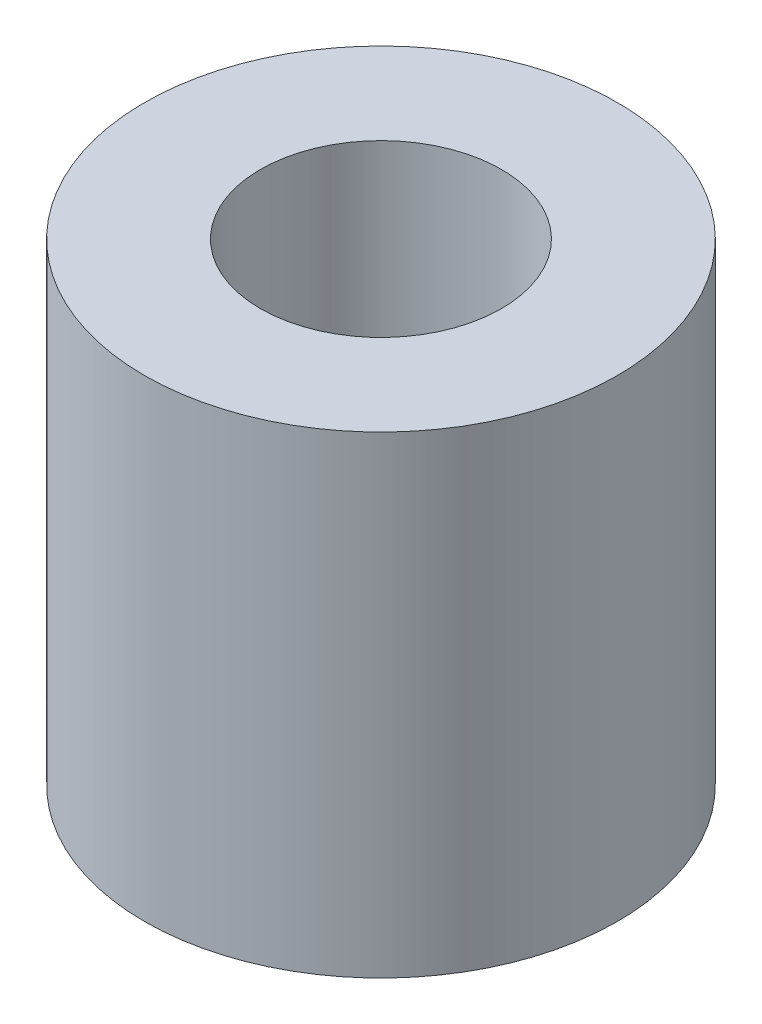
ISO-10303-21;
HEADER;
FILE_DESCRIPTION(('STEP AP214'),'2;1');
FILE_NAME('part.step','',(''),(''),'','','');
FILE_SCHEMA(('AUTOMOTIVE_DESIGN { 1 0 10303 214 1 1 1 1 }'));
ENDSEC;
DATA;
#1=APPLICATION_CONTEXT('core data for automotive mechanical design processes');
#2=APPLICATION_PROTOCOL_DEFINITION('international standard','automotive_design',2000,#1);
#3=PRODUCT_CONTEXT('',#1,'mechanical');
#4=PRODUCT('Part','Part','',(#3));
#5=PRODUCT_RELATED_PRODUCT_CATEGORY('part','',(#4));
#6=PRODUCT_DEFINITION_FORMATION('','',#4);
#7=PRODUCT_DEFINITION_CONTEXT('part definition',#1,'design');
#8=PRODUCT_DEFINITION('design','',#6,#7);
#9=PRODUCT_DEFINITION_SHAPE('','',#8);
#10=(LENGTH_UNIT() NAMED_UNIT(*) SI_UNIT(.MILLI.,.METRE.));
#11=(NAMED_UNIT(*) PLANE_ANGLE_UNIT() SI_UNIT($,.RADIAN.));
#12=(NAMED_UNIT(*) SI_UNIT($,.STERADIAN.) SOLID_ANGLE_UNIT());
#13=UNCERTAINTY_MEASURE_WITH_UNIT(LENGTH_MEASURE(1.E-05),#10,'distance_accuracy_value','');
#14=(GEOMETRIC_REPRESENTATION_CONTEXT(3) GLOBAL_UNCERTAINTY_ASSIGNED_CONTEXT((#13)) GLOBAL_UNIT_ASSIGNED_CONTEXT((#10,
#11,#12)) REPRESENTATION_CONTEXT('',''));
#15=CARTESIAN_POINT('',(0.,0.,0.));
#16=DIRECTION('',(0.,0.,1.));
#17=DIRECTION('',(1.,0.,0.));
#18=AXIS2_PLACEMENT_3D('',#15,#16,#17);
#19=CARTESIAN_POINT('',(0.,20.,0.));
#20=DIRECTION('',(0.,-1.,0.));
#21=DIRECTION('',(0.,0.,-1.));
#22=AXIS2_PLACEMENT_3D('',#19,#20,#21);
#23=CYLINDRICAL_SURFACE('',#22,10.);
#24=CARTESIAN_POINT('',(0.,20.,0.));
#25=DIRECTION('',(0.,1.,0.));
#26=DIRECTION('',(0.,0.,1.));
#27=AXIS2_PLACEMENT_3D('',#24,#25,#26);
#28=CIRCLE('',#27,10.);
#29=CARTESIAN_POINT('',(0.,20.,10.));
#30=VERTEX_POINT('',#29);
#31=EDGE_CURVE('E11',#30,#30,#28,.T.);
#32=ORIENTED_EDGE('',*,*,#31,.F.);
#33=EDGE_LOOP('',(#32));
#34=FACE_BOUND('',#33,.T.);
#35=CARTESIAN_POINT('',(0.,0.,0.));
#36=DIRECTION('',(0.,1.,0.));
#37=DIRECTION('',(0.,0.,1.));
#38=AXIS2_PLACEMENT_3D('',#35,#36,#37);
#39=CIRCLE('',#38,10.);
#40=CARTESIAN_POINT('',(0.,0.,10.));
#41=VERTEX_POINT('',#40);
#42=EDGE_CURVE('E40',#41,#41,#39,.T.);
#43=ORIENTED_EDGE('',*,*,#42,.T.);
#44=EDGE_LOOP('',(#43));
#45=FACE_BOUND('',#44,.T.);
#46=ADVANCED_FACE('F37',(#34,#45),#23,.T.);
#47=CARTESIAN_POINT('',(0.,20.,0.));
#48=DIRECTION('',(0.,1.,0.));
#49=DIRECTION('',(0.,0.,1.));
#50=AXIS2_PLACEMENT_3D('',#47,#48,#49);
#51=PLANE('',#50);
#52=CARTESIAN_POINT('',(0.,20.,0.));
#53=DIRECTION('',(0.,1.,0.));
#54=DIRECTION('',(0.,0.,1.));
#55=AXIS2_PLACEMENT_3D('',#52,#53,#54);
#56=CIRCLE('',#55,5.09999999999999);
#57=CARTESIAN_POINT('',(0.,20.,5.09999999999999));
#58=VERTEX_POINT('',#57);
#59=EDGE_CURVE('E56',#58,#58,#56,.T.);
#60=ORIENTED_EDGE('',*,*,#59,.F.);
#61=EDGE_LOOP('',(#60));
#62=FACE_BOUND('',#61,.T.);
#63=ORIENTED_EDGE('',*,*,#31,.T.);
#64=EDGE_LOOP('',(#63));
#65=FACE_BOUND('',#64,.T.);
#66=ADVANCED_FACE('F64',(#62,#65),#51,.T.);
#67=CARTESIAN_POINT('',(0.,0.,0.));
#68=DIRECTION('',(0.,1.,0.));
#69=DIRECTION('',(0.,0.,1.));
#70=AXIS2_PLACEMENT_3D('',#67,#68,#69);
#71=PLANE('',#70);
#72=ORIENTED_EDGE('',*,*,#42,.F.);
#73=EDGE_LOOP('',(#72));
#74=FACE_BOUND('',#73,.T.);
#75=ADVANCED_FACE('F50',(#74),#71,.F.);
#76=CARTESIAN_POINT('',(0.,4.,0.));
#77=DIRECTION('',(0.,1.,0.));
#78=DIRECTION('',(0.,0.,1.));
#79=AXIS2_PLACEMENT_3D('',#76,#77,#78);
#80=CONICAL_SURFACE('',#79,5.1,1.02974425867665);
#81=CARTESIAN_POINT('',(0.,0.935610842959442,0.));
#82=VERTEX_POINT('',#81);
#83=VERTEX_LOOP('',#82);
#84=FACE_BOUND('',#83,.T.);
#85=CARTESIAN_POINT('',(0.,4.,0.));
#86=DIRECTION('',(0.,1.,0.));
#87=DIRECTION('',(0.,0.,1.));
#88=AXIS2_PLACEMENT_3D('',#85,#86,#87);
#89=CIRCLE('',#88,5.1);
#90=CARTESIAN_POINT('',(0.,4.,5.1));
#91=VERTEX_POINT('',#90);
#92=EDGE_CURVE('E54',#91,#91,#89,.T.);
#93=ORIENTED_EDGE('',*,*,#92,.T.);
#94=EDGE_LOOP('',(#93));
#95=FACE_BOUND('',#94,.T.);
#96=ADVANCED_FACE('F46',(#84,#95),#80,.F.);
#97=CARTESIAN_POINT('',(0.,20.,0.));
#98=DIRECTION('',(0.,1.,0.));
#99=DIRECTION('',(0.,0.,1.));
#100=AXIS2_PLACEMENT_3D('',#97,#98,#99);
#101=CYLINDRICAL_SURFACE('',#100,5.09999999999999);
#102=ORIENTED_EDGE('',*,*,#92,.F.);
#103=EDGE_LOOP('',(#102));
#104=FACE_BOUND('',#103,.T.);
#105=ORIENTED_EDGE('',*,*,#59,.T.);
#106=EDGE_LOOP('',(#105));
#107=FACE_BOUND('',#106,.T.);
#108=ADVANCED_FACE('F49',(#104,#107),#101,.F.);
#109=CLOSED_SHELL('',(#46,#66,#75,#96,#108));
#110=MANIFOLD_SOLID_BREP('B2',#109);
#111=ADVANCED_BREP_SHAPE_REPRESENTATION('',(#18,#110),#14);
#112=SHAPE_DEFINITION_REPRESENTATION(#9,#111);
ENDSEC;
END-ISO-10303-21;
